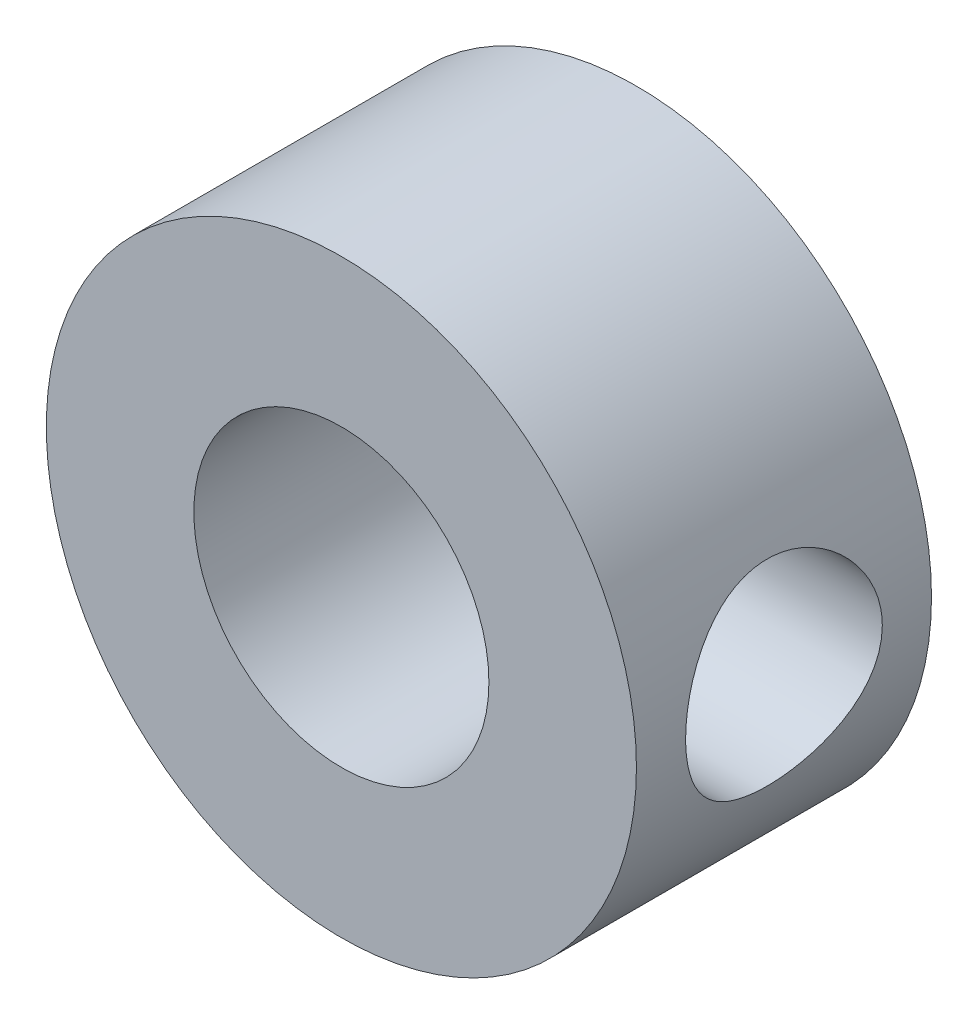
ISO-10303-21;
HEADER;
FILE_DESCRIPTION(('STEP AP214'),'2;1');
FILE_NAME('part.step','',(''),(''),'','','');
FILE_SCHEMA(('AUTOMOTIVE_DESIGN { 1 0 10303 214 1 1 1 1 }'));
ENDSEC;
DATA;
#1=APPLICATION_CONTEXT('core data for automotive mechanical design processes');
#2=APPLICATION_PROTOCOL_DEFINITION('international standard','automotive_design',2000,#1);
#3=PRODUCT_CONTEXT('',#1,'mechanical');
#4=PRODUCT('Part','Part','',(#3));
#5=PRODUCT_RELATED_PRODUCT_CATEGORY('part','',(#4));
#6=PRODUCT_DEFINITION_FORMATION('','',#4);
#7=PRODUCT_DEFINITION_CONTEXT('part definition',#1,'design');
#8=PRODUCT_DEFINITION('design','',#6,#7);
#9=PRODUCT_DEFINITION_SHAPE('','',#8);
#10=(LENGTH_UNIT() NAMED_UNIT(*) SI_UNIT(.MILLI.,.METRE.));
#11=(NAMED_UNIT(*) PLANE_ANGLE_UNIT() SI_UNIT($,.RADIAN.));
#12=(NAMED_UNIT(*) SI_UNIT($,.STERADIAN.) SOLID_ANGLE_UNIT());
#13=UNCERTAINTY_MEASURE_WITH_UNIT(LENGTH_MEASURE(1.E-05),#10,'distance_accuracy_value','');
#14=(GEOMETRIC_REPRESENTATION_CONTEXT(3) GLOBAL_UNCERTAINTY_ASSIGNED_CONTEXT((#13)) GLOBAL_UNIT_ASSIGNED_CONTEXT((#10,
#11,#12)) REPRESENTATION_CONTEXT('',''));
#15=CARTESIAN_POINT('',(0.,0.,0.));
#16=DIRECTION('',(0.,0.,1.));
#17=DIRECTION('',(1.,0.,0.));
#18=AXIS2_PLACEMENT_3D('',#15,#16,#17);
#19=CARTESIAN_POINT('',(-356.05,162.7,4.7625));
#20=DIRECTION('',(0.,0.,1.));
#21=DIRECTION('',(1.,0.,0.));
#22=AXIS2_PLACEMENT_3D('',#19,#20,#21);
#23=PLANE('',#22);
#24=CARTESIAN_POINT('',(-356.05,162.7,4.7625));
#25=DIRECTION('',(0.,0.,1.));
#26=DIRECTION('',(1.,0.,0.));
#27=AXIS2_PLACEMENT_3D('',#24,#25,#26);
#28=CIRCLE('',#27,9.52500000000002);
#29=CARTESIAN_POINT('',(-346.525,162.7,4.7625));
#30=VERTEX_POINT('',#29);
#31=EDGE_CURVE('E10',#30,#30,#28,.T.);
#32=ORIENTED_EDGE('',*,*,#31,.T.);
#33=EDGE_LOOP('',(#32));
#34=FACE_BOUND('',#33,.T.);
#35=CARTESIAN_POINT('',(-356.05,162.7,4.7625));
#36=DIRECTION('',(0.,0.,1.));
#37=DIRECTION('',(1.,0.,0.));
#38=AXIS2_PLACEMENT_3D('',#35,#36,#37);
#39=CIRCLE('',#38,4.76250000000001);
#40=CARTESIAN_POINT('',(-351.2875,162.7,4.7625));
#41=VERTEX_POINT('',#40);
#42=EDGE_CURVE('E48',#41,#41,#39,.T.);
#43=ORIENTED_EDGE('',*,*,#42,.F.);
#44=EDGE_LOOP('',(#43));
#45=FACE_BOUND('',#44,.T.);
#46=ADVANCED_FACE('F30',(#34,#45),#23,.T.);
#47=CARTESIAN_POINT('',(-356.05,162.7,-4.7625));
#48=DIRECTION('',(0.,0.,1.));
#49=DIRECTION('',(1.,0.,0.));
#50=AXIS2_PLACEMENT_3D('',#47,#48,#49);
#51=PLANE('',#50);
#52=CARTESIAN_POINT('',(-356.05,162.7,-4.7625));
#53=DIRECTION('',(0.,0.,1.));
#54=DIRECTION('',(1.,0.,0.));
#55=AXIS2_PLACEMENT_3D('',#52,#53,#54);
#56=CIRCLE('',#55,9.52500000000002);
#57=CARTESIAN_POINT('',(-346.525,162.7,-4.7625));
#58=VERTEX_POINT('',#57);
#59=EDGE_CURVE('E43',#58,#58,#56,.T.);
#60=ORIENTED_EDGE('',*,*,#59,.F.);
#61=EDGE_LOOP('',(#60));
#62=FACE_BOUND('',#61,.T.);
#63=CARTESIAN_POINT('',(-356.05,162.7,-4.7625));
#64=DIRECTION('',(0.,0.,1.));
#65=DIRECTION('',(1.,0.,0.));
#66=AXIS2_PLACEMENT_3D('',#63,#64,#65);
#67=CIRCLE('',#66,4.76250000000001);
#68=CARTESIAN_POINT('',(-351.2875,162.7,-4.7625));
#69=VERTEX_POINT('',#68);
#70=EDGE_CURVE('E50',#69,#69,#67,.T.);
#71=ORIENTED_EDGE('',*,*,#70,.T.);
#72=EDGE_LOOP('',(#71));
#73=FACE_BOUND('',#72,.T.);
#74=ADVANCED_FACE('F70',(#62,#73),#51,.F.);
#75=CARTESIAN_POINT('',(-356.05,162.7,4.7625));
#76=DIRECTION('',(0.,0.,-1.));
#77=DIRECTION('',(-1.,0.,0.));
#78=AXIS2_PLACEMENT_3D('',#75,#76,#77);
#79=CYLINDRICAL_SURFACE('',#78,9.52500000000002);
#80=CARTESIAN_POINT('',(-346.525,162.7,-3.17499999999999));
#81=CARTESIAN_POINT('',(-346.524999514195,162.526761322835,-3.17500080559795));
#82=CARTESIAN_POINT('',(-346.529769818135,162.35352750734,-3.16077515504608));
#83=CARTESIAN_POINT('',(-346.548329576046,162.012162409228,-3.10442257950532));
#84=CARTESIAN_POINT('',(-346.562119966332,161.844031658223,-3.06229275796216));
#85=CARTESIAN_POINT('',(-346.59722147397,161.517843393332,-2.95173640225564));
#86=CARTESIAN_POINT('',(-346.618520014545,161.359769552812,-2.8833538266918));
#87=CARTESIAN_POINT('',(-346.666463848474,161.057334575643,-2.72243177623823));
#88=CARTESIAN_POINT('',(-346.693110196298,160.912976151656,-2.62988753611673));
#89=CARTESIAN_POINT('',(-346.749977501435,160.637070181804,-2.41990306957345));
#90=CARTESIAN_POINT('',(-346.780284082275,160.506063251553,-2.30177583122293));
#91=CARTESIAN_POINT('',(-346.840585005636,160.265306200671,-2.04543928380665));
#92=CARTESIAN_POINT('',(-346.870579278025,160.155560761071,-1.90722556410196));
#93=CARTESIAN_POINT('',(-346.927801693847,159.957355808426,-1.60977225925123));
#94=CARTESIAN_POINT('',(-346.954925502997,159.869599075148,-1.4500423763505));
#95=CARTESIAN_POINT('',(-347.002034052959,159.722425075438,-1.11704090009411));
#96=CARTESIAN_POINT('',(-347.022020971896,159.662999160797,-0.94377345800828));
#97=CARTESIAN_POINT('',(-347.051691121197,159.576201759708,-0.594762521747935));
#98=CARTESIAN_POINT('',(-347.061698959315,159.547817301737,-0.419299363047211));
#99=CARTESIAN_POINT('',(-347.071237902013,159.520741933413,-0.065837580555066));
#100=CARTESIAN_POINT('',(-347.070772244028,159.522041847405,0.112160242751697));
#101=CARTESIAN_POINT('',(-347.05970127349,159.553511805742,0.456998801659788));
#102=CARTESIAN_POINT('',(-347.049560296206,159.582359825695,0.623977679267905));
#103=CARTESIAN_POINT('',(-347.021041117245,159.665950432953,0.950574107251719));
#104=CARTESIAN_POINT('',(-347.002661929355,159.720696120571,1.11019077375637));
#105=CARTESIAN_POINT('',(-346.959406321583,159.855393490659,1.42053547995296));
#106=CARTESIAN_POINT('',(-346.934430036068,159.935736895354,1.57107898086576));
#107=CARTESIAN_POINT('',(-346.880836265221,160.119077087487,1.85696513378815));
#108=CARTESIAN_POINT('',(-346.852217729153,160.222080418244,1.9923033780135));
#109=CARTESIAN_POINT('',(-346.792737298924,160.454165868734,2.25136582416047));
#110=CARTESIAN_POINT('',(-346.761836287984,160.584328748508,2.37411480506631));
#111=CARTESIAN_POINT('',(-346.702579706212,160.863771865345,2.5962967716563));
#112=CARTESIAN_POINT('',(-346.674224379666,161.013053933777,2.69572752117229));
#113=CARTESIAN_POINT('',(-346.622881822975,161.328566328578,2.86923575324635));
#114=CARTESIAN_POINT('',(-346.599950637245,161.494950097378,2.94305193500683));
#115=CARTESIAN_POINT('',(-346.562446993164,161.838720660318,3.06134507730939));
#116=CARTESIAN_POINT('',(-346.547871631458,162.016103608858,3.10583222946942));
#117=CARTESIAN_POINT('',(-346.529202840482,162.368581341244,3.16247673962099));
#118=CARTESIAN_POINT('',(-346.524682441779,162.543442020429,3.17595189412349));
#119=CARTESIAN_POINT('',(-346.525352339439,162.892960847124,3.17394376132486));
#120=CARTESIAN_POINT('',(-346.530540996685,163.06761902384,3.15846536206389));
#121=CARTESIAN_POINT('',(-346.549764215232,163.406500575516,3.10003219293833));
#122=CARTESIAN_POINT('',(-346.56353819092,163.570879661701,3.05788629579286));
#123=CARTESIAN_POINT('',(-346.598283863145,163.89016766849,2.94832581381814));
#124=CARTESIAN_POINT('',(-346.619256477518,164.045075378515,2.88090800668978));
#125=CARTESIAN_POINT('',(-346.666956431629,164.345565341049,2.7207513789055));
#126=CARTESIAN_POINT('',(-346.693820631504,164.490795120514,2.62739316632592));
#127=CARTESIAN_POINT('',(-346.750258188159,164.76395583568,2.41873357370718));
#128=CARTESIAN_POINT('',(-346.779832370896,164.891881467751,2.30342549209913));
#129=CARTESIAN_POINT('',(-346.840060076621,165.132851712285,2.04794246555407));
#130=CARTESIAN_POINT('',(-346.870701585474,165.244956077355,1.90687570450721));
#131=CARTESIAN_POINT('',(-346.928225847893,165.444017633377,1.60727527220042));
#132=CARTESIAN_POINT('',(-346.955108570121,165.530974614681,1.44874145533679));
#133=CARTESIAN_POINT('',(-347.001809060624,165.676870254072,1.11863817645457));
#134=CARTESIAN_POINT('',(-347.021641094823,165.735865569624,0.947095898639159));
#135=CARTESIAN_POINT('',(-347.05170607427,165.823865566961,0.595697786109879));
#136=CARTESIAN_POINT('',(-347.061943343699,165.852883759479,0.415845734841184));
#137=CARTESIAN_POINT('',(-347.071167980745,165.879052196865,0.0628742200700841));
#138=CARTESIAN_POINT('',(-347.070706291827,165.877763066954,-0.110116430410671));
#139=CARTESIAN_POINT('',(-347.059947183092,165.847194281699,-0.453279112877555));
#140=CARTESIAN_POINT('',(-347.049650348673,165.817916292281,-0.623451312007412));
#141=CARTESIAN_POINT('',(-347.02079135332,165.733305506686,-0.952930730032853));
#142=CARTESIAN_POINT('',(-347.002389887786,165.678478123599,-1.11238291938928));
#143=CARTESIAN_POINT('',(-346.959454337514,165.544734486287,-1.41994701702901));
#144=CARTESIAN_POINT('',(-346.934918891762,165.465812885158,-1.56805639902193));
#145=CARTESIAN_POINT('',(-346.881145172073,165.282102698952,-1.85573565200525));
#146=CARTESIAN_POINT('',(-346.851748405362,165.176335670777,-1.99465089352738));
#147=CARTESIAN_POINT('',(-346.792228438007,164.943591153956,-2.25326515749484));
#148=CARTESIAN_POINT('',(-346.762105034032,164.816607668133,-2.37295872780964));
#149=CARTESIAN_POINT('',(-346.703116530814,164.539091943223,-2.59443350901814));
#150=CARTESIAN_POINT('',(-346.67434622781,164.387834805362,-2.69533480410943));
#151=CARTESIAN_POINT('',(-346.62259978027,164.069559609766,-2.8701696116008));
#152=CARTESIAN_POINT('',(-346.599622154923,163.90254559507,-2.94411001830248));
#153=CARTESIAN_POINT('',(-346.562924896574,163.565167329863,-3.05981618315153));
#154=CARTESIAN_POINT('',(-346.548837505585,163.395286130623,-3.10287183038621));
#155=CARTESIAN_POINT('',(-346.529876575711,163.050267320832,-3.16045939114987));
#156=CARTESIAN_POINT('',(-346.525000491112,162.875131176181,-3.1749991856015));
#157=CARTESIAN_POINT('',(-346.525,162.7,-3.17499999999999));
#158=B_SPLINE_CURVE_WITH_KNOTS('',3,(#80,#81,#82,#83,#84,#85,#86,#87,#88,#89,#90,#91,#92,#93,
#94,#95,#96,#97,#98,#99,#100,#101,#102,#103,#104,#105,#106,#107,#108,#109,#110,#111,#112,#113,
#114,#115,#116,#117,#118,#119,#120,#121,#122,#123,#124,#125,#126,#127,#128,#129,#130,#131,#132,
#133,#134,#135,#136,#137,#138,#139,#140,#141,#142,#143,#144,#145,#146,#147,#148,#149,#150,#151,
#152,#153,#154,#155,#156,#157),.UNSPECIFIED.,.T.,.F.,(4,2,2,2,2,2,2,2,2,2,2,2,2,2,2,2,2,2,2,2,2,
2,2,2,2,2,2,2,2,2,2,2,2,2,2,2,2,2,4),(0.,0.519071561632605,1.03819701322439,1.55645698636314,
2.07481924951215,2.6093637259775,3.14402575687909,3.69406121814518,4.24392866899746,
4.77526114230343,5.30642937910268,5.81332424300316,6.32027980466157,6.83539943417542,
7.35066800622308,7.89283745951091,8.43505888444015,8.98265937939886,9.53006948685137,
10.0537512658117,10.5773446429626,11.0857715158083,11.5942632377703,12.1161301950386,
12.638156741095,13.1839024764639,13.7296527614612,14.274292439,14.8186865394104,
15.3351123975402,15.8515075194062,16.3580948898032,16.8647947620873,17.3936046174648,
17.92256420318,18.4721392315144,19.0215736265905,19.5464607283686,20.0712027467109),.UNSPECIFIED.);
#159=CARTESIAN_POINT('',(-346.525,162.7,-3.17499999999999));
#160=VERTEX_POINT('',#159);
#161=EDGE_CURVE('E53',#160,#160,#158,.T.);
#162=ORIENTED_EDGE('',*,*,#161,.T.);
#163=EDGE_LOOP('',(#162));
#164=FACE_BOUND('',#163,.T.);
#165=ORIENTED_EDGE('',*,*,#31,.F.);
#166=EDGE_LOOP('',(#165));
#167=FACE_BOUND('',#166,.T.);
#168=ORIENTED_EDGE('',*,*,#59,.T.);
#169=EDGE_LOOP('',(#168));
#170=FACE_BOUND('',#169,.T.);
#171=ADVANCED_FACE('F32',(#164,#167,#170),#79,.T.);
#172=CARTESIAN_POINT('',(-356.05,162.7,4.7625));
#173=DIRECTION('',(0.,0.,-1.));
#174=DIRECTION('',(-1.,0.,0.));
#175=AXIS2_PLACEMENT_3D('',#172,#173,#174);
#176=CYLINDRICAL_SURFACE('',#175,4.76250000000001);
#177=CARTESIAN_POINT('',(-351.2875,162.7,-3.17499999999999));
#178=CARTESIAN_POINT('',(-351.287501704412,162.540486493853,-3.17499785387674));
#179=CARTESIAN_POINT('',(-351.295584140181,162.380963177059,-3.16291201378244));
#180=CARTESIAN_POINT('',(-351.32711300858,162.067009666731,-3.11531578752959));
#181=CARTESIAN_POINT('',(-351.3505667353,161.912581927743,-3.07979428046729));
#182=CARTESIAN_POINT('',(-351.410523760635,161.613813388142,-2.98750378332686));
#183=CARTESIAN_POINT('',(-351.446965920653,161.469429054354,-2.93083428235373));
#184=CARTESIAN_POINT('',(-351.52997251583,161.192803110827,-2.79866196869854));
#185=CARTESIAN_POINT('',(-351.576538420519,161.060563267912,-2.72315642160036));
#186=CARTESIAN_POINT('',(-351.680766159943,160.799310572142,-2.54848209446024));
#187=CARTESIAN_POINT('',(-351.739034254616,160.671523774407,-2.44784901636419));
#188=CARTESIAN_POINT('',(-351.859280776106,160.433481719711,-2.22927855246793));
#189=CARTESIAN_POINT('',(-351.921264442029,160.323252059321,-2.11131637522971));
#190=CARTESIAN_POINT('',(-352.053813799447,160.105671026381,-1.83982936485521));
#191=CARTESIAN_POINT('',(-352.124190796812,160.00151691731,-1.68363002512642));
#192=CARTESIAN_POINT('',(-352.25453916045,159.821063081583,-1.35197313839845));
#193=CARTESIAN_POINT('',(-352.314528426643,159.744715184169,-1.17654958761285));
#194=CARTESIAN_POINT('',(-352.399126767121,159.641299694325,-0.862470821626453));
#195=CARTESIAN_POINT('',(-352.428950157231,159.606368150165,-0.72782358104304));
#196=CARTESIAN_POINT('',(-352.47402973163,159.554358942623,-0.45284309874215));
#197=CARTESIAN_POINT('',(-352.489311021148,159.537250504884,-0.312520093909052));
#198=CARTESIAN_POINT('',(-352.502943886011,159.521962094274,-0.0294087885535945));
#199=CARTESIAN_POINT('',(-352.501226259516,159.52385949371,0.113387224758067));
#200=CARTESIAN_POINT('',(-352.480986064069,159.546628396307,0.396295520403474));
#201=CARTESIAN_POINT('',(-352.462449257956,159.567515974374,0.536405426371812));
#202=CARTESIAN_POINT('',(-352.412605922874,159.625568216887,0.804016443958596));
#203=CARTESIAN_POINT('',(-352.381898874551,159.661974080576,0.931801121179946));
#204=CARTESIAN_POINT('',(-352.311284737649,159.749311867801,1.17955010979676));
#205=CARTESIAN_POINT('',(-352.271374622556,159.800248571247,1.29951183185714));
#206=CARTESIAN_POINT('',(-352.177068381901,159.927053127505,1.55420281498848));
#207=CARTESIAN_POINT('',(-352.121376955706,160.0058846697,1.68697259197918));
#208=CARTESIAN_POINT('',(-352.006771838643,160.181130253074,1.93894614005393));
#209=CARTESIAN_POINT('',(-351.947854237037,160.27756597964,2.05813288170832));
#210=CARTESIAN_POINT('',(-351.818624417693,160.509549000497,2.30591129113202));
#211=CARTESIAN_POINT('',(-351.748593427546,160.649046229744,2.43099280228032));
#212=CARTESIAN_POINT('',(-351.617412651955,160.950562301463,2.65619943508342));
#213=CARTESIAN_POINT('',(-351.556254579841,161.112559849792,2.75634790583763));
#214=CARTESIAN_POINT('',(-351.459816710062,161.422288199484,2.91064587831314));
#215=CARTESIAN_POINT('',(-351.421814228996,161.566592241147,2.96996383930039));
#216=CARTESIAN_POINT('',(-351.358814960392,161.864917780253,3.06721656943046));
#217=CARTESIAN_POINT('',(-351.333807182475,162.018930942085,3.10516941057244));
#218=CARTESIAN_POINT('',(-351.29899537076,162.333310593089,3.15779334981528));
#219=CARTESIAN_POINT('',(-351.289257005929,162.493701498554,3.17236389423949));
#220=CARTESIAN_POINT('',(-351.286180549928,162.81500091203,3.17697975309251));
#221=CARTESIAN_POINT('',(-351.292841312253,162.975909383071,3.1670267820259));
#222=CARTESIAN_POINT('',(-351.32084401789,163.281748451062,3.12479681179544));
#223=CARTESIAN_POINT('',(-351.341121838555,163.427007443428,3.09413703981372));
#224=CARTESIAN_POINT('',(-351.393569617603,163.709834772978,3.01371684845448));
#225=CARTESIAN_POINT('',(-351.425741472516,163.847401879643,2.96395338290101));
#226=CARTESIAN_POINT('',(-351.5018704036,164.120280291365,2.84376447844171));
#227=CARTESIAN_POINT('',(-351.546423311595,164.254950193105,2.77227005539699));
#228=CARTESIAN_POINT('',(-351.643070542166,164.51083430053,2.61233715220839));
#229=CARTESIAN_POINT('',(-351.695169517334,164.632040122759,2.52388820764803));
#230=CARTESIAN_POINT('',(-351.812096571881,164.877818947043,2.31678500930829));
#231=CARTESIAN_POINT('',(-351.877634760814,164.999893602711,2.19556606216413));
#232=CARTESIAN_POINT('',(-352.008682627244,165.223076743058,1.93498560490981));
#233=CARTESIAN_POINT('',(-352.074192254054,165.324170736641,1.79561166279189));
#234=CARTESIAN_POINT('',(-352.193332596399,165.495980827873,1.51266141984505));
#235=CARTESIAN_POINT('',(-352.247499397422,165.568543224039,1.37043789728915));
#236=CARTESIAN_POINT('',(-352.34415628332,165.692377392578,1.07335216383615));
#237=CARTESIAN_POINT('',(-352.386667337829,165.743687485664,0.918513308918436));
#238=CARTESIAN_POINT('',(-352.447435320724,165.815244016686,0.627753877826392));
#239=CARTESIAN_POINT('',(-352.468679408545,165.839417742087,0.49343975609332));
#240=CARTESIAN_POINT('',(-352.49591346816,165.870224888317,0.221339911640295));
#241=CARTESIAN_POINT('',(-352.501920008208,165.876877360844,0.0835581242545066));
#242=CARTESIAN_POINT('',(-352.497743314644,165.87220478265,-0.191520836727918));
#243=CARTESIAN_POINT('',(-352.487550494694,165.86086908703,-0.328817675150217));
#244=CARTESIAN_POINT('',(-352.452559038581,165.820977251746,-0.599032910654151));
#245=CARTESIAN_POINT('',(-352.427740917535,165.792398137942,-0.731945216428466));
#246=CARTESIAN_POINT('',(-352.358636492593,165.709789815611,-1.02506622898967));
#247=CARTESIAN_POINT('',(-352.310924789874,165.651008291477,-1.18311132192875));
#248=CARTESIAN_POINT('',(-352.204722605997,165.51121528101,-1.48508652360585));
#249=CARTESIAN_POINT('',(-352.146217029739,165.43017258413,-1.6289964271167));
#250=CARTESIAN_POINT('',(-352.023829409737,165.246328732373,-1.90385549633637));
#251=CARTESIAN_POINT('',(-351.959868885793,165.143158372503,-2.03452106373605));
#252=CARTESIAN_POINT('',(-351.833142249845,164.917266607591,-2.27859138405742));
#253=CARTESIAN_POINT('',(-351.770376510401,164.794539212497,-2.39199082772431));
#254=CARTESIAN_POINT('',(-351.676665018613,164.587385066011,-2.55491858498313));
#255=CARTESIAN_POINT('',(-351.643586874511,164.509013443643,-2.61102761986733));
#256=CARTESIAN_POINT('',(-351.58038094277,164.346659819349,-2.71633779885706));
#257=CARTESIAN_POINT('',(-351.550251801218,164.262680422077,-2.76554211752336));
#258=CARTESIAN_POINT('',(-351.493831729275,164.089607151134,-2.85642356224378));
#259=CARTESIAN_POINT('',(-351.467537239978,164.000518128062,-2.89810767636215));
#260=CARTESIAN_POINT('',(-351.419579430049,163.817829600981,-2.97335672820605));
#261=CARTESIAN_POINT('',(-351.397914483387,163.724231694825,-3.00692451716838));
#262=CARTESIAN_POINT('',(-351.349418903476,163.480235392827,-3.08154139984117));
#263=CARTESIAN_POINT('',(-351.326378961317,163.327104096318,-3.11642765689177));
#264=CARTESIAN_POINT('',(-351.295424347127,163.015982580686,-3.16314936096944));
#265=CARTESIAN_POINT('',(-351.287498311801,162.857996102785,-3.17500212570784));
#266=CARTESIAN_POINT('',(-351.2875,162.7,-3.17499999999999));
#267=B_SPLINE_CURVE_WITH_KNOTS('',3,(#177,#178,#179,#180,#181,#182,#183,#184,#185,#186,#187,
#188,#189,#190,#191,#192,#193,#194,#195,#196,#197,#198,#199,#200,#201,#202,#203,#204,#205,#206,
#207,#208,#209,#210,#211,#212,#213,#214,#215,#216,#217,#218,#219,#220,#221,#222,#223,#224,#225,
#226,#227,#228,#229,#230,#231,#232,#233,#234,#235,#236,#237,#238,#239,#240,#241,#242,#243,#244,
#245,#246,#247,#248,#249,#250,#251,#252,#253,#254,#255,#256,#257,#258,#259,#260,#261,#262,#263,
#264,#265,#266),.UNSPECIFIED.,.T.,.F.,(4,2,2,2,2,2,2,2,2,2,2,2,2,2,2,2,2,2,2,2,2,2,2,2,2,2,2,2,
2,2,2,2,2,2,2,2,2,2,2,2,2,2,2,2,4),(0.,0.477921997077364,0.956070945278554,1.43199826818951,
1.90799472139479,2.42438283538387,2.94151703421857,3.54023109732374,4.13790297394638,
4.563009887107,4.98738156455223,5.41348154879913,5.83994255655571,6.24758818745147,
6.65536806800919,7.14609274784496,7.63742604761198,8.23466340273953,8.83133933988773,
9.31106989228964,9.79039404549573,10.2717740223998,10.7531203456965,11.200655221184,
11.6482614879236,12.1229810060221,12.5979944723586,13.1481222963465,13.6986288317687,
14.2025677230621,14.705593948025,15.1181442623597,15.5302458053914,15.9425913096207,
16.3554874162604,16.8784049132826,17.4020593249786,17.9352455177248,18.4685953331297,
18.7739424593009,19.0791487337135,19.3840699212457,19.6888838348845,20.1626158186784,
20.635991489477),.UNSPECIFIED.);
#268=CARTESIAN_POINT('',(-351.2875,162.7,-3.17499999999999));
#269=VERTEX_POINT('',#268);
#270=EDGE_CURVE('E35',#269,#269,#267,.T.);
#271=ORIENTED_EDGE('',*,*,#270,.F.);
#272=EDGE_LOOP('',(#271));
#273=FACE_BOUND('',#272,.T.);
#274=ORIENTED_EDGE('',*,*,#42,.T.);
#275=EDGE_LOOP('',(#274));
#276=FACE_BOUND('',#275,.T.);
#277=ORIENTED_EDGE('',*,*,#70,.F.);
#278=EDGE_LOOP('',(#277));
#279=FACE_BOUND('',#278,.T.);
#280=ADVANCED_FACE('F62',(#273,#276,#279),#176,.F.);
#281=CARTESIAN_POINT('',(-354.553259536908,162.7,0.));
#282=DIRECTION('',(1.,0.,0.));
#283=DIRECTION('',(0.,0.,-1.));
#284=AXIS2_PLACEMENT_3D('',#281,#282,#283);
#285=CYLINDRICAL_SURFACE('',#284,3.175);
#286=ORIENTED_EDGE('',*,*,#270,.T.);
#287=EDGE_LOOP('',(#286));
#288=FACE_BOUND('',#287,.T.);
#289=ORIENTED_EDGE('',*,*,#161,.F.);
#290=EDGE_LOOP('',(#289));
#291=FACE_BOUND('',#290,.T.);
#292=ADVANCED_FACE('F59',(#288,#291),#285,.F.);
#293=CLOSED_SHELL('',(#46,#74,#171,#280,#292));
#294=MANIFOLD_SOLID_BREP('B2',#293);
#295=ADVANCED_BREP_SHAPE_REPRESENTATION('',(#18,#294),#14);
#296=SHAPE_DEFINITION_REPRESENTATION(#9,#295);
ENDSEC;
END-ISO-10303-21;
